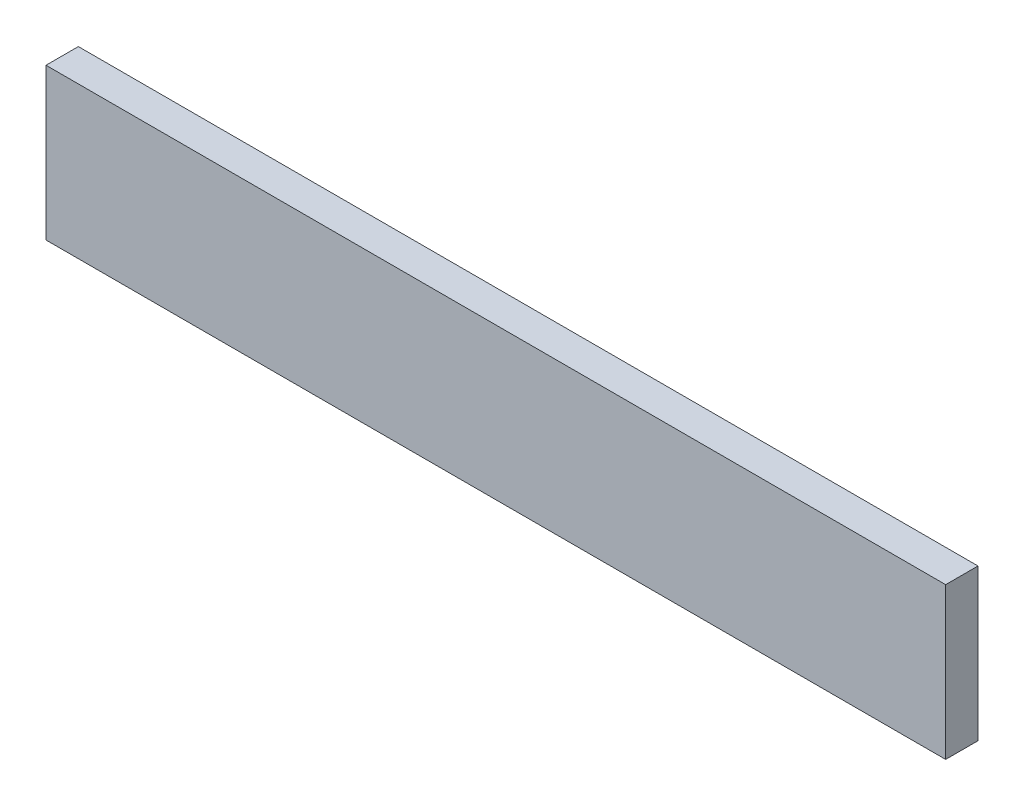
ISO-10303-21;
HEADER;
FILE_DESCRIPTION(('STEP AP214'),'2;1');
FILE_NAME('part.step','',(''),(''),'','','');
FILE_SCHEMA(('AUTOMOTIVE_DESIGN { 1 0 10303 214 1 1 1 1 }'));
ENDSEC;
DATA;
#1=APPLICATION_CONTEXT('core data for automotive mechanical design processes');
#2=APPLICATION_PROTOCOL_DEFINITION('international standard','automotive_design',2000,#1);
#3=PRODUCT_CONTEXT('',#1,'mechanical');
#4=PRODUCT('Part','Part','',(#3));
#5=PRODUCT_RELATED_PRODUCT_CATEGORY('part','',(#4));
#6=PRODUCT_DEFINITION_FORMATION('','',#4);
#7=PRODUCT_DEFINITION_CONTEXT('part definition',#1,'design');
#8=PRODUCT_DEFINITION('design','',#6,#7);
#9=PRODUCT_DEFINITION_SHAPE('','',#8);
#10=(LENGTH_UNIT() NAMED_UNIT(*) SI_UNIT(.MILLI.,.METRE.));
#11=(NAMED_UNIT(*) PLANE_ANGLE_UNIT() SI_UNIT($,.RADIAN.));
#12=(NAMED_UNIT(*) SI_UNIT($,.STERADIAN.) SOLID_ANGLE_UNIT());
#13=UNCERTAINTY_MEASURE_WITH_UNIT(LENGTH_MEASURE(1.E-05),#10,'distance_accuracy_value','');
#14=(GEOMETRIC_REPRESENTATION_CONTEXT(3) GLOBAL_UNCERTAINTY_ASSIGNED_CONTEXT((#13)) GLOBAL_UNIT_ASSIGNED_CONTEXT((#10,
#11,#12)) REPRESENTATION_CONTEXT('',''));
#15=CARTESIAN_POINT('',(0.,0.,0.));
#16=DIRECTION('',(0.,0.,1.));
#17=DIRECTION('',(1.,0.,0.));
#18=AXIS2_PLACEMENT_3D('',#15,#16,#17);
#19=CARTESIAN_POINT('',(8.72452990443659,27.0131188383402,1.));
#20=DIRECTION('',(-1.,0.,0.));
#21=DIRECTION('',(0.,0.,1.));
#22=AXIS2_PLACEMENT_3D('',#19,#20,#21);
#23=PLANE('',#22);
#24=DIRECTION('',(0.,1.,0.));
#25=VECTOR('',#24,1.);
#26=CARTESIAN_POINT('',(8.72452990443659,27.0131188383402,0.));
#27=LINE('',#26,#25);
#28=CARTESIAN_POINT('',(8.72452990443659,22.3344827586207,0.));
#29=VERTEX_POINT('',#28);
#30=CARTESIAN_POINT('',(8.72452990443659,27.0131188383402,0.));
#31=VERTEX_POINT('',#30);
#32=EDGE_CURVE('E96',#29,#31,#27,.T.);
#33=ORIENTED_EDGE('',*,*,#32,.T.);
#34=DIRECTION('',(0.,0.,-1.));
#35=VECTOR('',#34,1.);
#36=CARTESIAN_POINT('',(8.72452990443659,27.0131188383402,1.));
#37=LINE('',#36,#35);
#38=CARTESIAN_POINT('',(8.72452990443659,27.0131188383402,1.));
#39=VERTEX_POINT('',#38);
#40=EDGE_CURVE('E11',#39,#31,#37,.T.);
#41=ORIENTED_EDGE('',*,*,#40,.F.);
#42=DIRECTION('',(0.,1.,0.));
#43=VECTOR('',#42,1.);
#44=CARTESIAN_POINT('',(8.72452990443659,27.0131188383402,1.));
#45=LINE('',#44,#43);
#46=CARTESIAN_POINT('',(8.72452990443659,22.3344827586207,1.));
#47=VERTEX_POINT('',#46);
#48=EDGE_CURVE('E84',#47,#39,#45,.T.);
#49=ORIENTED_EDGE('',*,*,#48,.F.);
#50=DIRECTION('',(0.,0.,-1.));
#51=VECTOR('',#50,1.);
#52=CARTESIAN_POINT('',(8.72452990443659,22.3344827586207,1.));
#53=LINE('',#52,#51);
#54=EDGE_CURVE('E92',#47,#29,#53,.T.);
#55=ORIENTED_EDGE('',*,*,#54,.T.);
#56=EDGE_LOOP('',(#33,#41,#49,#55));
#57=FACE_BOUND('',#56,.T.);
#58=ADVANCED_FACE('F33',(#57),#23,.F.);
#59=CARTESIAN_POINT('',(-19.0814907059007,27.0131188383402,1.));
#60=DIRECTION('',(0.,-1.,0.));
#61=DIRECTION('',(0.,0.,-1.));
#62=AXIS2_PLACEMENT_3D('',#59,#60,#61);
#63=PLANE('',#62);
#64=DIRECTION('',(-1.,0.,0.));
#65=VECTOR('',#64,1.);
#66=CARTESIAN_POINT('',(-19.0814907059007,27.0131188383402,0.));
#67=LINE('',#66,#65);
#68=CARTESIAN_POINT('',(-19.0814907059007,27.0131188383402,0.));
#69=VERTEX_POINT('',#68);
#70=EDGE_CURVE('E88',#31,#69,#67,.T.);
#71=ORIENTED_EDGE('',*,*,#70,.T.);
#72=DIRECTION('',(0.,0.,-1.));
#73=VECTOR('',#72,1.);
#74=CARTESIAN_POINT('',(-19.0814907059007,27.0131188383402,1.));
#75=LINE('',#74,#73);
#76=CARTESIAN_POINT('',(-19.0814907059007,27.0131188383402,1.));
#77=VERTEX_POINT('',#76);
#78=EDGE_CURVE('E41',#77,#69,#75,.T.);
#79=ORIENTED_EDGE('',*,*,#78,.F.);
#80=DIRECTION('',(-1.,0.,0.));
#81=VECTOR('',#80,1.);
#82=CARTESIAN_POINT('',(-19.0814907059007,27.0131188383402,1.));
#83=LINE('',#82,#81);
#84=EDGE_CURVE('E79',#39,#77,#83,.T.);
#85=ORIENTED_EDGE('',*,*,#84,.F.);
#86=ORIENTED_EDGE('',*,*,#40,.T.);
#87=EDGE_LOOP('',(#71,#79,#85,#86));
#88=FACE_BOUND('',#87,.T.);
#89=ADVANCED_FACE('F87',(#88),#63,.F.);
#90=CARTESIAN_POINT('',(-19.0814907059007,27.0131188383402,1.));
#91=DIRECTION('',(1.,0.,0.));
#92=DIRECTION('',(0.,0.,-1.));
#93=AXIS2_PLACEMENT_3D('',#90,#91,#92);
#94=PLANE('',#93);
#95=DIRECTION('',(0.,-1.,0.));
#96=VECTOR('',#95,1.);
#97=CARTESIAN_POINT('',(-19.0814907059007,27.0131188383402,0.));
#98=LINE('',#97,#96);
#99=CARTESIAN_POINT('',(-19.0814907059007,22.3344827586207,0.));
#100=VERTEX_POINT('',#99);
#101=EDGE_CURVE('E66',#69,#100,#98,.T.);
#102=ORIENTED_EDGE('',*,*,#101,.T.);
#103=DIRECTION('',(0.,0.,-1.));
#104=VECTOR('',#103,1.);
#105=CARTESIAN_POINT('',(-19.0814907059007,22.3344827586207,1.));
#106=LINE('',#105,#104);
#107=CARTESIAN_POINT('',(-19.0814907059007,22.3344827586207,1.));
#108=VERTEX_POINT('',#107);
#109=EDGE_CURVE('E89',#108,#100,#106,.T.);
#110=ORIENTED_EDGE('',*,*,#109,.F.);
#111=DIRECTION('',(0.,-1.,0.));
#112=VECTOR('',#111,1.);
#113=CARTESIAN_POINT('',(-19.0814907059007,27.0131188383402,1.));
#114=LINE('',#113,#112);
#115=EDGE_CURVE('E82',#77,#108,#114,.T.);
#116=ORIENTED_EDGE('',*,*,#115,.F.);
#117=ORIENTED_EDGE('',*,*,#78,.T.);
#118=EDGE_LOOP('',(#102,#110,#116,#117));
#119=FACE_BOUND('',#118,.T.);
#120=ADVANCED_FACE('F90',(#119),#94,.F.);
#121=CARTESIAN_POINT('',(-19.0814907059007,22.3344827586207,1.));
#122=DIRECTION('',(0.,1.,0.));
#123=DIRECTION('',(0.,0.,1.));
#124=AXIS2_PLACEMENT_3D('',#121,#122,#123);
#125=PLANE('',#124);
#126=DIRECTION('',(1.,0.,0.));
#127=VECTOR('',#126,1.);
#128=CARTESIAN_POINT('',(-19.0814907059007,22.3344827586207,0.));
#129=LINE('',#128,#127);
#130=EDGE_CURVE('E72',#100,#29,#129,.T.);
#131=ORIENTED_EDGE('',*,*,#130,.T.);
#132=ORIENTED_EDGE('',*,*,#54,.F.);
#133=DIRECTION('',(1.,0.,0.));
#134=VECTOR('',#133,1.);
#135=CARTESIAN_POINT('',(-19.0814907059007,22.3344827586207,1.));
#136=LINE('',#135,#134);
#137=EDGE_CURVE('E49',#108,#47,#136,.T.);
#138=ORIENTED_EDGE('',*,*,#137,.F.);
#139=ORIENTED_EDGE('',*,*,#109,.T.);
#140=EDGE_LOOP('',(#131,#132,#138,#139));
#141=FACE_BOUND('',#140,.T.);
#142=ADVANCED_FACE('F103',(#141),#125,.F.);
#143=CARTESIAN_POINT('',(0.,0.,1.));
#144=DIRECTION('',(0.,0.,1.));
#145=DIRECTION('',(1.,0.,0.));
#146=AXIS2_PLACEMENT_3D('',#143,#144,#145);
#147=PLANE('',#146);
#148=ORIENTED_EDGE('',*,*,#48,.T.);
#149=ORIENTED_EDGE('',*,*,#84,.T.);
#150=ORIENTED_EDGE('',*,*,#115,.T.);
#151=ORIENTED_EDGE('',*,*,#137,.T.);
#152=EDGE_LOOP('',(#148,#149,#150,#151));
#153=FACE_BOUND('',#152,.T.);
#154=ADVANCED_FACE('F80',(#153),#147,.T.);
#155=CARTESIAN_POINT('',(0.,0.,0.));
#156=DIRECTION('',(0.,0.,1.));
#157=DIRECTION('',(1.,0.,0.));
#158=AXIS2_PLACEMENT_3D('',#155,#156,#157);
#159=PLANE('',#158);
#160=ORIENTED_EDGE('',*,*,#32,.F.);
#161=ORIENTED_EDGE('',*,*,#130,.F.);
#162=ORIENTED_EDGE('',*,*,#101,.F.);
#163=ORIENTED_EDGE('',*,*,#70,.F.);
#164=EDGE_LOOP('',(#160,#161,#162,#163));
#165=FACE_BOUND('',#164,.T.);
#166=ADVANCED_FACE('F106',(#165),#159,.F.);
#167=CLOSED_SHELL('',(#58,#89,#120,#142,#154,#166));
#168=MANIFOLD_SOLID_BREP('B2',#167);
#169=ADVANCED_BREP_SHAPE_REPRESENTATION('',(#18,#168),#14);
#170=SHAPE_DEFINITION_REPRESENTATION(#9,#169);
ENDSEC;
END-ISO-10303-21;
